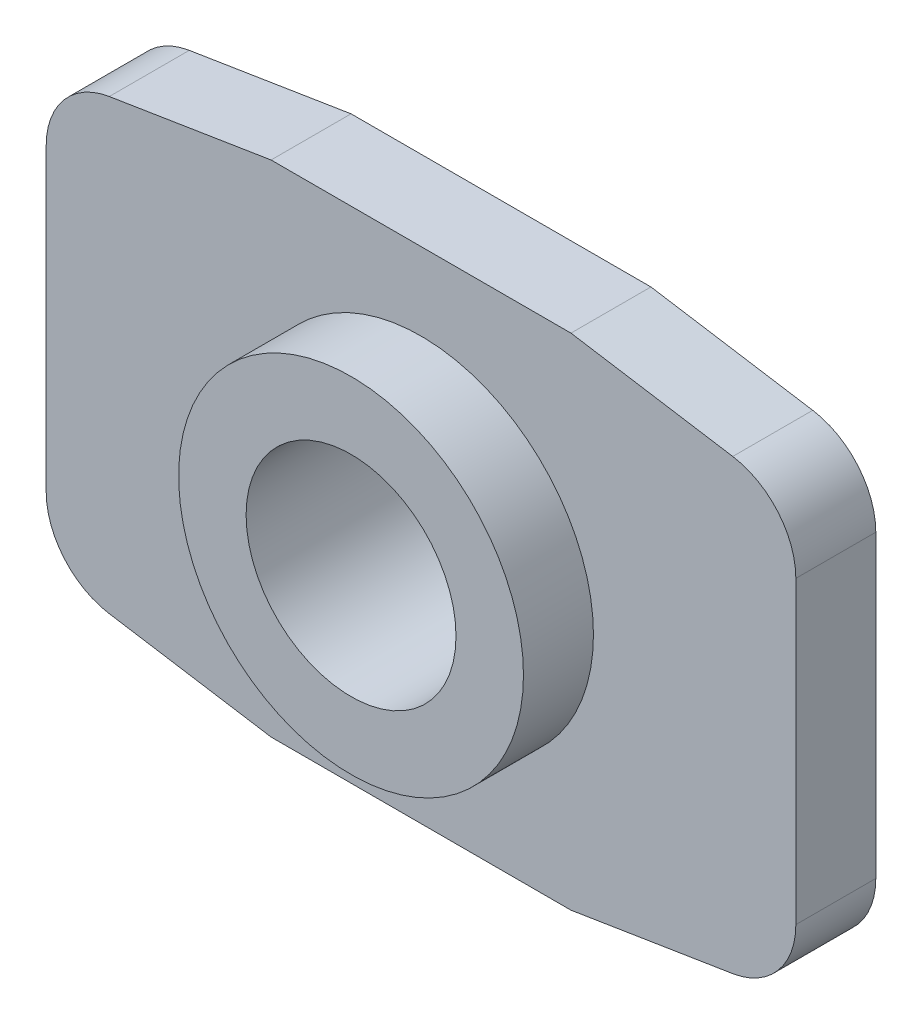
ISO-10303-21;
HEADER;
FILE_DESCRIPTION(('STEP AP214'),'2;1');
FILE_NAME('part.step','',(''),(''),'','','');
FILE_SCHEMA(('AUTOMOTIVE_DESIGN { 1 0 10303 214 1 1 1 1 }'));
ENDSEC;
DATA;
#1=APPLICATION_CONTEXT('core data for automotive mechanical design processes');
#2=APPLICATION_PROTOCOL_DEFINITION('international standard','automotive_design',2000,#1);
#3=PRODUCT_CONTEXT('',#1,'mechanical');
#4=PRODUCT('Part','Part','',(#3));
#5=PRODUCT_RELATED_PRODUCT_CATEGORY('part','',(#4));
#6=PRODUCT_DEFINITION_FORMATION('','',#4);
#7=PRODUCT_DEFINITION_CONTEXT('part definition',#1,'design');
#8=PRODUCT_DEFINITION('design','',#6,#7);
#9=PRODUCT_DEFINITION_SHAPE('','',#8);
#10=(LENGTH_UNIT() NAMED_UNIT(*) SI_UNIT(.MILLI.,.METRE.));
#11=(NAMED_UNIT(*) PLANE_ANGLE_UNIT() SI_UNIT($,.RADIAN.));
#12=(NAMED_UNIT(*) SI_UNIT($,.STERADIAN.) SOLID_ANGLE_UNIT());
#13=UNCERTAINTY_MEASURE_WITH_UNIT(LENGTH_MEASURE(1.E-05),#10,'distance_accuracy_value','');
#14=(GEOMETRIC_REPRESENTATION_CONTEXT(3) GLOBAL_UNCERTAINTY_ASSIGNED_CONTEXT((#13)) GLOBAL_UNIT_ASSIGNED_CONTEXT((#10,
#11,#12)) REPRESENTATION_CONTEXT('',''));
#15=CARTESIAN_POINT('',(0.,0.,0.));
#16=DIRECTION('',(0.,0.,1.));
#17=DIRECTION('',(1.,0.,0.));
#18=AXIS2_PLACEMENT_3D('',#15,#16,#17);
#19=CARTESIAN_POINT('',(6.00000000000023,3.00000000000333,1.59999999986882));
#20=DIRECTION('',(0.,0.,1.00000000000001));
#21=DIRECTION('',(1.00000000000001,0.,0.));
#22=AXIS2_PLACEMENT_3D('',#19,#20,#21);
#23=PLANE('',#22);
#24=CARTESIAN_POINT('',(6.00000000000023,3.00000000000333,1.59999999986882));
#25=DIRECTION('',(0.,0.,1.00000000000001));
#26=DIRECTION('',(1.00000000000001,0.,0.));
#27=AXIS2_PLACEMENT_3D('',#24,#25,#26);
#28=CIRCLE('',#27,1.5);
#29=CARTESIAN_POINT('',(7.50000000000028,3.00000000000393,1.59999999986926));
#30=VERTEX_POINT('',#29);
#31=CARTESIAN_POINT('',(6.23739675280444,4.48109512921095,1.59999999982974));
#32=VERTEX_POINT('',#31);
#33=EDGE_CURVE('E180',#30,#32,#28,.T.);
#34=ORIENTED_EDGE('',*,*,#33,.T.);
#35=DIRECTION('',(-0.98739675280409,0.158264501869375,0.));
#36=VECTOR('',#35,1.);
#37=CARTESIAN_POINT('',(6.23739675280444,4.48109512921095,1.59999999982974));
#38=LINE('',#37,#36);
#39=CARTESIAN_POINT('',(3.00000000000011,5.00000000000553,1.59999999982974));
#40=VERTEX_POINT('',#39);
#41=EDGE_CURVE('E108',#32,#40,#38,.T.);
#42=ORIENTED_EDGE('',*,*,#41,.T.);
#43=DIRECTION('',(-1.00000000000001,0.,0.));
#44=VECTOR('',#43,1.);
#45=CARTESIAN_POINT('',(-3.00000000000011,5.00000000000481,1.59999999983018));
#46=LINE('',#45,#44);
#47=CARTESIAN_POINT('',(-3.00000000000011,5.00000000000481,1.59999999983018));
#48=VERTEX_POINT('',#47);
#49=EDGE_CURVE('E207',#40,#48,#46,.T.);
#50=ORIENTED_EDGE('',*,*,#49,.T.);
#51=DIRECTION('',(-0.987396752804088,-0.158264501869399,0.));
#52=VECTOR('',#51,1.);
#53=CARTESIAN_POINT('',(-6.23739675280444,4.48109512921006,1.59999999982974));
#54=LINE('',#53,#52);
#55=CARTESIAN_POINT('',(-6.23739675280444,4.48109512921006,1.59999999982974));
#56=VERTEX_POINT('',#55);
#57=EDGE_CURVE('E225',#48,#56,#54,.T.);
#58=ORIENTED_EDGE('',*,*,#57,.T.);
#59=CARTESIAN_POINT('',(-6.00000000000023,3.00000000000249,1.59999999986882));
#60=DIRECTION('',(0.,0.,1.00000000000001));
#61=DIRECTION('',(-1.00000000000001,0.,0.));
#62=AXIS2_PLACEMENT_3D('',#59,#60,#61);
#63=CIRCLE('',#62,1.5);
#64=CARTESIAN_POINT('',(-7.50000000000028,3.00000000000378,1.59999999986882));
#65=VERTEX_POINT('',#64);
#66=EDGE_CURVE('E222',#56,#65,#63,.T.);
#67=ORIENTED_EDGE('',*,*,#66,.T.);
#68=DIRECTION('',(0.,-1.00000000000001,0.));
#69=VECTOR('',#68,1.);
#70=CARTESIAN_POINT('',(-7.50000000000028,-2.99999999999603,1.59999999999982));
#71=LINE('',#70,#69);
#72=CARTESIAN_POINT('',(-7.50000000000028,-2.99999999999603,1.59999999999982));
#73=VERTEX_POINT('',#72);
#74=EDGE_CURVE('E224',#65,#73,#71,.T.);
#75=ORIENTED_EDGE('',*,*,#74,.T.);
#76=CARTESIAN_POINT('',(-6.00000000000023,-2.99999999999774,1.59999999999982));
#77=DIRECTION('',(0.,0.,1.00000000000001));
#78=DIRECTION('',(1.00000000000001,0.,0.));
#79=AXIS2_PLACEMENT_3D('',#76,#77,#78);
#80=CIRCLE('',#79,1.5);
#81=CARTESIAN_POINT('',(-6.23739675280444,-4.48109512920229,1.59999999999982));
#82=VERTEX_POINT('',#81);
#83=EDGE_CURVE('E227',#73,#82,#80,.T.);
#84=ORIENTED_EDGE('',*,*,#83,.T.);
#85=DIRECTION('',(0.987396752804089,-0.158264501869373,0.));
#86=VECTOR('',#85,1.);
#87=CARTESIAN_POINT('',(-6.23739675280444,-4.48109512920229,1.59999999999982));
#88=LINE('',#87,#86);
#89=CARTESIAN_POINT('',(-3.00000000000011,-4.99999999999519,1.59999999999982));
#90=VERTEX_POINT('',#89);
#91=EDGE_CURVE('E233',#82,#90,#88,.T.);
#92=ORIENTED_EDGE('',*,*,#91,.T.);
#93=DIRECTION('',(1.00000000000001,0.,0.));
#94=VECTOR('',#93,1.);
#95=CARTESIAN_POINT('',(-3.00000000000011,-4.99999999999519,1.59999999999982));
#96=LINE('',#95,#94);
#97=CARTESIAN_POINT('',(3.00000000000011,-4.9999999999947,1.59999999999982));
#98=VERTEX_POINT('',#97);
#99=EDGE_CURVE('E139',#90,#98,#96,.T.);
#100=ORIENTED_EDGE('',*,*,#99,.T.);
#101=DIRECTION('',(0.987396752804086,0.158264501869398,0.));
#102=VECTOR('',#101,1.);
#103=CARTESIAN_POINT('',(6.23739675280444,-4.48109512920146,1.59999999999982));
#104=LINE('',#103,#102);
#105=CARTESIAN_POINT('',(6.23739675280444,-4.48109512920146,1.59999999999982));
#106=VERTEX_POINT('',#105);
#107=EDGE_CURVE('E133',#98,#106,#104,.T.);
#108=ORIENTED_EDGE('',*,*,#107,.T.);
#109=CARTESIAN_POINT('',(6.00000000000023,-2.99999999999648,1.59999999999982));
#110=DIRECTION('',(0.,0.,1.00000000000001));
#111=DIRECTION('',(-1.00000000000001,0.,0.));
#112=AXIS2_PLACEMENT_3D('',#109,#110,#111);
#113=CIRCLE('',#112,1.5);
#114=CARTESIAN_POINT('',(7.50000000000028,-2.99999999999634,1.59999999999982));
#115=VERTEX_POINT('',#114);
#116=EDGE_CURVE('E137',#106,#115,#113,.T.);
#117=ORIENTED_EDGE('',*,*,#116,.T.);
#118=DIRECTION('',(0.,1.,0.));
#119=VECTOR('',#118,1.);
#120=CARTESIAN_POINT('',(7.50000000000028,-2.99999999999634,1.59999999999982));
#121=LINE('',#120,#119);
#122=EDGE_CURVE('E53',#115,#30,#121,.T.);
#123=ORIENTED_EDGE('',*,*,#122,.T.);
#124=EDGE_LOOP('',(#34,#42,#50,#58,#67,#75,#84,#92,#100,#108,#117,#123));
#125=FACE_BOUND('',#124,.T.);
#126=CARTESIAN_POINT('',(0.,2.24820162486594E-12,1.59999999999982));
#127=DIRECTION('',(0.,0.,1.00000000000001));
#128=DIRECTION('',(1.00000000000001,0.,0.));
#129=AXIS2_PLACEMENT_3D('',#126,#127,#128);
#130=CIRCLE('',#129,3.45);
#131=CARTESIAN_POINT('',(3.45000000000004,2.29186669642445E-12,1.59999999999982));
#132=VERTEX_POINT('',#131);
#133=EDGE_CURVE('E285',#132,#132,#130,.T.);
#134=ORIENTED_EDGE('',*,*,#133,.F.);
#135=EDGE_LOOP('',(#134));
#136=FACE_BOUND('',#135,.T.);
#137=ADVANCED_FACE('F36',(#125,#136),#23,.T.);
#138=CARTESIAN_POINT('',(6.00000000000023,3.00000000000333,1.59999999986882));
#139=DIRECTION('',(0.,0.,-1.00000000000001));
#140=DIRECTION('',(-1.00000000000001,0.,0.));
#141=AXIS2_PLACEMENT_3D('',#138,#139,#140);
#142=CYLINDRICAL_SURFACE('',#141,1.5);
#143=CARTESIAN_POINT('',(6.00000000000023,3.00000000000168,-1.31006316905768E-10));
#144=DIRECTION('',(0.,0.,1.00000000000001));
#145=DIRECTION('',(1.00000000000001,0.,0.));
#146=AXIS2_PLACEMENT_3D('',#143,#144,#145);
#147=CIRCLE('',#146,1.5);
#148=CARTESIAN_POINT('',(7.50000000000028,3.00000000000167,-1.31006316905768E-10));
#149=VERTEX_POINT('',#148);
#150=CARTESIAN_POINT('',(6.23739675280444,4.48109512920856,-1.70086167372574E-10));
#151=VERTEX_POINT('',#150);
#152=EDGE_CURVE('E157',#149,#151,#147,.T.);
#153=ORIENTED_EDGE('',*,*,#152,.T.);
#154=DIRECTION('',(0.,0.,-1.00000000000001));
#155=VECTOR('',#154,1.);
#156=CARTESIAN_POINT('',(6.23739675280444,4.48109512921095,1.59999999982974));
#157=LINE('',#156,#155);
#158=EDGE_CURVE('E11',#32,#151,#157,.T.);
#159=ORIENTED_EDGE('',*,*,#158,.F.);
#160=ORIENTED_EDGE('',*,*,#33,.F.);
#161=DIRECTION('',(0.,0.,-1.00000000000001));
#162=VECTOR('',#161,1.);
#163=CARTESIAN_POINT('',(7.50000000000028,3.00000000000393,1.59999999986926));
#164=LINE('',#163,#162);
#165=EDGE_CURVE('E153',#30,#149,#164,.T.);
#166=ORIENTED_EDGE('',*,*,#165,.T.);
#167=EDGE_LOOP('',(#153,#159,#160,#166));
#168=FACE_BOUND('',#167,.T.);
#169=ADVANCED_FACE('F38',(#168),#142,.T.);
#170=CARTESIAN_POINT('',(6.23739675280444,4.48109512921095,1.59999999982974));
#171=DIRECTION('',(-0.158264501869399,-0.987396752804084,0.));
#172=DIRECTION('',(0.98739675280409,-0.158264501869375,0.));
#173=AXIS2_PLACEMENT_3D('',#170,#171,#172);
#174=PLANE('',#173);
#175=DIRECTION('',(-0.98739675280409,0.158264501869375,0.));
#176=VECTOR('',#175,1.);
#177=CARTESIAN_POINT('',(6.23739675280444,4.48109512920856,-1.70086167372574E-10));
#178=LINE('',#177,#176);
#179=CARTESIAN_POINT('',(3.00000000000011,5.00000000000309,-1.70086167372574E-10));
#180=VERTEX_POINT('',#179);
#181=EDGE_CURVE('E160',#151,#180,#178,.T.);
#182=ORIENTED_EDGE('',*,*,#181,.T.);
#183=DIRECTION('',(0.,0.,-1.00000000000001));
#184=VECTOR('',#183,1.);
#185=CARTESIAN_POINT('',(3.00000000000011,5.00000000000553,1.59999999982974));
#186=LINE('',#185,#184);
#187=EDGE_CURVE('E45',#40,#180,#186,.T.);
#188=ORIENTED_EDGE('',*,*,#187,.F.);
#189=ORIENTED_EDGE('',*,*,#41,.F.);
#190=ORIENTED_EDGE('',*,*,#158,.T.);
#191=EDGE_LOOP('',(#182,#188,#189,#190));
#192=FACE_BOUND('',#191,.T.);
#193=ADVANCED_FACE('F263',(#192),#174,.F.);
#194=CARTESIAN_POINT('',(-3.00000000000011,5.00000000000481,1.59999999983018));
#195=DIRECTION('',(0.,-1.00000000000001,0.));
#196=DIRECTION('',(0.,0.,-1.00000000000001));
#197=AXIS2_PLACEMENT_3D('',#194,#195,#196);
#198=PLANE('',#197);
#199=DIRECTION('',(-1.00000000000001,0.,0.));
#200=VECTOR('',#199,1.);
#201=CARTESIAN_POINT('',(-3.00000000000011,5.00000000000245,-1.70086167372574E-10));
#202=LINE('',#201,#200);
#203=CARTESIAN_POINT('',(-3.00000000000011,5.00000000000245,-1.70086167372574E-10));
#204=VERTEX_POINT('',#203);
#205=EDGE_CURVE('E163',#180,#204,#202,.T.);
#206=ORIENTED_EDGE('',*,*,#205,.T.);
#207=DIRECTION('',(0.,0.,-1.00000000000001));
#208=VECTOR('',#207,1.);
#209=CARTESIAN_POINT('',(-3.00000000000011,5.00000000000481,1.59999999983018));
#210=LINE('',#209,#208);
#211=EDGE_CURVE('E199',#48,#204,#210,.T.);
#212=ORIENTED_EDGE('',*,*,#211,.F.);
#213=ORIENTED_EDGE('',*,*,#49,.F.);
#214=ORIENTED_EDGE('',*,*,#187,.T.);
#215=EDGE_LOOP('',(#206,#212,#213,#214));
#216=FACE_BOUND('',#215,.T.);
#217=ADVANCED_FACE('F205',(#216),#198,.F.);
#218=CARTESIAN_POINT('',(-6.23739675280444,4.48109512921006,1.59999999982974));
#219=DIRECTION('',(0.158264501869376,-0.987396752804085,0.));
#220=DIRECTION('',(0.987396752804088,0.158264501869399,0.));
#221=AXIS2_PLACEMENT_3D('',#218,#219,#220);
#222=PLANE('',#221);
#223=DIRECTION('',(-0.987396752804088,-0.158264501869399,0.));
#224=VECTOR('',#223,1.);
#225=CARTESIAN_POINT('',(-6.23739675280444,4.48109512920765,-1.70086167372574E-10));
#226=LINE('',#225,#224);
#227=CARTESIAN_POINT('',(-6.23739675280444,4.48109512920765,-1.70086167372574E-10));
#228=VERTEX_POINT('',#227);
#229=EDGE_CURVE('E165',#204,#228,#226,.T.);
#230=ORIENTED_EDGE('',*,*,#229,.T.);
#231=DIRECTION('',(0.,0.,-1.00000000000001));
#232=VECTOR('',#231,1.);
#233=CARTESIAN_POINT('',(-6.23739675280444,4.48109512921006,1.59999999982974));
#234=LINE('',#233,#232);
#235=EDGE_CURVE('E196',#56,#228,#234,.T.);
#236=ORIENTED_EDGE('',*,*,#235,.F.);
#237=ORIENTED_EDGE('',*,*,#57,.F.);
#238=ORIENTED_EDGE('',*,*,#211,.T.);
#239=EDGE_LOOP('',(#230,#236,#237,#238));
#240=FACE_BOUND('',#239,.T.);
#241=ADVANCED_FACE('F216',(#240),#222,.F.);
#242=CARTESIAN_POINT('',(-6.00000000000023,3.00000000000249,1.59999999986882));
#243=DIRECTION('',(0.,0.,-1.00000000000001));
#244=DIRECTION('',(-1.00000000000001,0.,0.));
#245=AXIS2_PLACEMENT_3D('',#242,#243,#244);
#246=CYLINDRICAL_SURFACE('',#245,1.5);
#247=CARTESIAN_POINT('',(-6.00000000000023,3.00000000000018,-1.31006316905768E-10));
#248=DIRECTION('',(0.,0.,1.00000000000001));
#249=DIRECTION('',(-1.00000000000001,0.,0.));
#250=AXIS2_PLACEMENT_3D('',#247,#248,#249);
#251=CIRCLE('',#250,1.5);
#252=CARTESIAN_POINT('',(-7.50000000000028,3.00000000000131,-1.31006316905768E-10));
#253=VERTEX_POINT('',#252);
#254=EDGE_CURVE('E167',#228,#253,#251,.T.);
#255=ORIENTED_EDGE('',*,*,#254,.T.);
#256=DIRECTION('',(0.,0.,-1.00000000000001));
#257=VECTOR('',#256,1.);
#258=CARTESIAN_POINT('',(-7.50000000000028,3.00000000000378,1.59999999986882));
#259=LINE('',#258,#257);
#260=EDGE_CURVE('E193',#65,#253,#259,.T.);
#261=ORIENTED_EDGE('',*,*,#260,.F.);
#262=ORIENTED_EDGE('',*,*,#66,.F.);
#263=ORIENTED_EDGE('',*,*,#235,.T.);
#264=EDGE_LOOP('',(#255,#261,#262,#263));
#265=FACE_BOUND('',#264,.T.);
#266=ADVANCED_FACE('F220',(#265),#246,.T.);
#267=CARTESIAN_POINT('',(-7.50000000000028,-2.99999999999603,1.59999999999982));
#268=DIRECTION('',(1.00000000000001,0.,0.));
#269=DIRECTION('',(0.,0.,-1.00000000000001));
#270=AXIS2_PLACEMENT_3D('',#267,#268,#269);
#271=PLANE('',#270);
#272=DIRECTION('',(0.,-1.00000000000001,0.));
#273=VECTOR('',#272,1.);
#274=CARTESIAN_POINT('',(-7.50000000000028,-2.99999999999875,0.));
#275=LINE('',#274,#273);
#276=CARTESIAN_POINT('',(-7.50000000000028,-2.99999999999875,0.));
#277=VERTEX_POINT('',#276);
#278=EDGE_CURVE('E169',#253,#277,#275,.T.);
#279=ORIENTED_EDGE('',*,*,#278,.T.);
#280=DIRECTION('',(0.,0.,-1.00000000000001));
#281=VECTOR('',#280,1.);
#282=CARTESIAN_POINT('',(-7.50000000000028,-2.99999999999603,1.59999999999982));
#283=LINE('',#282,#281);
#284=EDGE_CURVE('E190',#73,#277,#283,.T.);
#285=ORIENTED_EDGE('',*,*,#284,.F.);
#286=ORIENTED_EDGE('',*,*,#74,.F.);
#287=ORIENTED_EDGE('',*,*,#260,.T.);
#288=EDGE_LOOP('',(#279,#285,#286,#287));
#289=FACE_BOUND('',#288,.T.);
#290=ADVANCED_FACE('F354',(#289),#271,.F.);
#291=CARTESIAN_POINT('',(-6.00000000000023,-2.99999999999774,1.59999999999982));
#292=DIRECTION('',(0.,0.,-1.00000000000001));
#293=DIRECTION('',(-1.00000000000001,0.,0.));
#294=AXIS2_PLACEMENT_3D('',#291,#292,#293);
#295=CYLINDRICAL_SURFACE('',#294,1.5);
#296=CARTESIAN_POINT('',(-6.00000000000023,-2.99999999999961,0.));
#297=DIRECTION('',(0.,0.,1.00000000000001));
#298=DIRECTION('',(1.00000000000001,0.,0.));
#299=AXIS2_PLACEMENT_3D('',#296,#297,#298);
#300=CIRCLE('',#299,1.5);
#301=CARTESIAN_POINT('',(-6.23739675280444,-4.48109512920442,0.));
#302=VERTEX_POINT('',#301);
#303=EDGE_CURVE('E171',#277,#302,#300,.T.);
#304=ORIENTED_EDGE('',*,*,#303,.T.);
#305=DIRECTION('',(0.,0.,-1.00000000000001));
#306=VECTOR('',#305,1.);
#307=CARTESIAN_POINT('',(-6.23739675280444,-4.48109512920229,1.59999999999982));
#308=LINE('',#307,#306);
#309=EDGE_CURVE('E187',#82,#302,#308,.T.);
#310=ORIENTED_EDGE('',*,*,#309,.F.);
#311=ORIENTED_EDGE('',*,*,#83,.F.);
#312=ORIENTED_EDGE('',*,*,#284,.T.);
#313=EDGE_LOOP('',(#304,#310,#311,#312));
#314=FACE_BOUND('',#313,.T.);
#315=ADVANCED_FACE('F345',(#314),#295,.T.);
#316=CARTESIAN_POINT('',(-6.23739675280444,-4.48109512920229,1.59999999999982));
#317=DIRECTION('',(0.158264501869399,0.987396752804084,0.));
#318=DIRECTION('',(-0.987396752804089,0.158264501869374,0.));
#319=AXIS2_PLACEMENT_3D('',#316,#317,#318);
#320=PLANE('',#319);
#321=DIRECTION('',(0.987396752804089,-0.158264501869373,0.));
#322=VECTOR('',#321,1.);
#323=CARTESIAN_POINT('',(-6.23739675280444,-4.48109512920442,0.));
#324=LINE('',#323,#322);
#325=CARTESIAN_POINT('',(-3.00000000000011,-4.99999999999726,0.));
#326=VERTEX_POINT('',#325);
#327=EDGE_CURVE('E173',#302,#326,#324,.T.);
#328=ORIENTED_EDGE('',*,*,#327,.T.);
#329=DIRECTION('',(0.,0.,-1.00000000000001));
#330=VECTOR('',#329,1.);
#331=CARTESIAN_POINT('',(-3.00000000000011,-4.99999999999519,1.59999999999982));
#332=LINE('',#331,#330);
#333=EDGE_CURVE('E184',#90,#326,#332,.T.);
#334=ORIENTED_EDGE('',*,*,#333,.F.);
#335=ORIENTED_EDGE('',*,*,#91,.F.);
#336=ORIENTED_EDGE('',*,*,#309,.T.);
#337=EDGE_LOOP('',(#328,#334,#335,#336));
#338=FACE_BOUND('',#337,.T.);
#339=ADVANCED_FACE('F239',(#338),#320,.F.);
#340=CARTESIAN_POINT('',(-3.00000000000011,-4.99999999999519,1.59999999999982));
#341=DIRECTION('',(0.,1.00000000000001,0.));
#342=DIRECTION('',(0.,0.,1.00000000000001));
#343=AXIS2_PLACEMENT_3D('',#340,#341,#342);
#344=PLANE('',#343);
#345=DIRECTION('',(1.00000000000001,0.,0.));
#346=VECTOR('',#345,1.);
#347=CARTESIAN_POINT('',(-3.00000000000011,-4.99999999999726,0.));
#348=LINE('',#347,#346);
#349=CARTESIAN_POINT('',(3.00000000000011,-4.99999999999716,0.));
#350=VERTEX_POINT('',#349);
#351=EDGE_CURVE('E175',#326,#350,#348,.T.);
#352=ORIENTED_EDGE('',*,*,#351,.T.);
#353=DIRECTION('',(0.,0.,-1.00000000000001));
#354=VECTOR('',#353,1.);
#355=CARTESIAN_POINT('',(3.00000000000011,-4.9999999999947,1.59999999999982));
#356=LINE('',#355,#354);
#357=EDGE_CURVE('E148',#98,#350,#356,.T.);
#358=ORIENTED_EDGE('',*,*,#357,.F.);
#359=ORIENTED_EDGE('',*,*,#99,.F.);
#360=ORIENTED_EDGE('',*,*,#333,.T.);
#361=EDGE_LOOP('',(#352,#358,#359,#360));
#362=FACE_BOUND('',#361,.T.);
#363=ADVANCED_FACE('F243',(#362),#344,.F.);
#364=CARTESIAN_POINT('',(6.23739675280444,-4.48109512920146,1.59999999999982));
#365=DIRECTION('',(-0.158264501869375,0.987396752804085,0.));
#366=DIRECTION('',(-0.987396752804087,-0.158264501869399,0.));
#367=AXIS2_PLACEMENT_3D('',#364,#365,#366);
#368=PLANE('',#367);
#369=DIRECTION('',(0.987396752804086,0.158264501869398,0.));
#370=VECTOR('',#369,1.);
#371=CARTESIAN_POINT('',(6.23739675280444,-4.48109512920382,0.));
#372=LINE('',#371,#370);
#373=CARTESIAN_POINT('',(6.23739675280444,-4.48109512920382,0.));
#374=VERTEX_POINT('',#373);
#375=EDGE_CURVE('E147',#350,#374,#372,.T.);
#376=ORIENTED_EDGE('',*,*,#375,.T.);
#377=DIRECTION('',(0.,0.,-1.00000000000001));
#378=VECTOR('',#377,1.);
#379=CARTESIAN_POINT('',(6.23739675280444,-4.48109512920146,1.59999999999982));
#380=LINE('',#379,#378);
#381=EDGE_CURVE('E144',#106,#374,#380,.T.);
#382=ORIENTED_EDGE('',*,*,#381,.F.);
#383=ORIENTED_EDGE('',*,*,#107,.F.);
#384=ORIENTED_EDGE('',*,*,#357,.T.);
#385=EDGE_LOOP('',(#376,#382,#383,#384));
#386=FACE_BOUND('',#385,.T.);
#387=ADVANCED_FACE('F145',(#386),#368,.F.);
#388=CARTESIAN_POINT('',(6.00000000000023,-2.99999999999648,1.59999999999982));
#389=DIRECTION('',(0.,0.,-1.00000000000001));
#390=DIRECTION('',(-1.00000000000001,0.,0.));
#391=AXIS2_PLACEMENT_3D('',#388,#389,#390);
#392=CYLINDRICAL_SURFACE('',#391,1.5);
#393=CARTESIAN_POINT('',(6.00000000000023,-2.99999999999866,0.));
#394=DIRECTION('',(0.,0.,1.00000000000001));
#395=DIRECTION('',(-1.00000000000001,0.,0.));
#396=AXIS2_PLACEMENT_3D('',#393,#394,#395);
#397=CIRCLE('',#396,1.5);
#398=CARTESIAN_POINT('',(7.50000000000028,-2.99999999999873,0.));
#399=VERTEX_POINT('',#398);
#400=EDGE_CURVE('E94',#374,#399,#397,.T.);
#401=ORIENTED_EDGE('',*,*,#400,.T.);
#402=DIRECTION('',(0.,0.,-1.00000000000001));
#403=VECTOR('',#402,1.);
#404=CARTESIAN_POINT('',(7.50000000000028,-2.99999999999634,1.59999999999982));
#405=LINE('',#404,#403);
#406=EDGE_CURVE('E149',#115,#399,#405,.T.);
#407=ORIENTED_EDGE('',*,*,#406,.F.);
#408=ORIENTED_EDGE('',*,*,#116,.F.);
#409=ORIENTED_EDGE('',*,*,#381,.T.);
#410=EDGE_LOOP('',(#401,#407,#408,#409));
#411=FACE_BOUND('',#410,.T.);
#412=ADVANCED_FACE('F151',(#411),#392,.T.);
#413=CARTESIAN_POINT('',(7.50000000000028,-2.99999999999634,1.59999999999982));
#414=DIRECTION('',(-1.00000000000001,0.,0.));
#415=DIRECTION('',(0.,-1.,0.));
#416=AXIS2_PLACEMENT_3D('',#413,#414,#415);
#417=PLANE('',#416);
#418=DIRECTION('',(0.,1.,0.));
#419=VECTOR('',#418,1.);
#420=CARTESIAN_POINT('',(7.50000000000028,-2.99999999999873,0.));
#421=LINE('',#420,#419);
#422=EDGE_CURVE('E100',#399,#149,#421,.T.);
#423=ORIENTED_EDGE('',*,*,#422,.T.);
#424=ORIENTED_EDGE('',*,*,#165,.F.);
#425=ORIENTED_EDGE('',*,*,#122,.F.);
#426=ORIENTED_EDGE('',*,*,#406,.T.);
#427=EDGE_LOOP('',(#423,#424,#425,#426));
#428=FACE_BOUND('',#427,.T.);
#429=ADVANCED_FACE('F247',(#428),#417,.F.);
#430=CARTESIAN_POINT('',(6.00000000000023,3.00000000000168,-1.31006316905768E-10));
#431=DIRECTION('',(0.,0.,1.00000000000001));
#432=DIRECTION('',(1.00000000000001,0.,0.));
#433=AXIS2_PLACEMENT_3D('',#430,#431,#432);
#434=PLANE('',#433);
#435=CARTESIAN_POINT('',(0.,0.,0.));
#436=DIRECTION('',(0.,0.,1.00000000000001));
#437=DIRECTION('',(1.00000000000001,0.,0.));
#438=AXIS2_PLACEMENT_3D('',#435,#436,#437);
#439=CIRCLE('',#438,2.1);
#440=CARTESIAN_POINT('',(2.10000000000002,0.,0.));
#441=VERTEX_POINT('',#440);
#442=EDGE_CURVE('E280',#441,#441,#439,.T.);
#443=ORIENTED_EDGE('',*,*,#442,.T.);
#444=EDGE_LOOP('',(#443));
#445=FACE_BOUND('',#444,.T.);
#446=ORIENTED_EDGE('',*,*,#152,.F.);
#447=ORIENTED_EDGE('',*,*,#422,.F.);
#448=ORIENTED_EDGE('',*,*,#400,.F.);
#449=ORIENTED_EDGE('',*,*,#375,.F.);
#450=ORIENTED_EDGE('',*,*,#351,.F.);
#451=ORIENTED_EDGE('',*,*,#327,.F.);
#452=ORIENTED_EDGE('',*,*,#303,.F.);
#453=ORIENTED_EDGE('',*,*,#278,.F.);
#454=ORIENTED_EDGE('',*,*,#254,.F.);
#455=ORIENTED_EDGE('',*,*,#229,.F.);
#456=ORIENTED_EDGE('',*,*,#205,.F.);
#457=ORIENTED_EDGE('',*,*,#181,.F.);
#458=EDGE_LOOP('',(#446,#447,#448,#449,#450,#451,#452,#453,#454,#455,#456,#457));
#459=FACE_BOUND('',#458,.T.);
#460=ADVANCED_FACE('F211',(#445,#459),#434,.F.);
#461=CARTESIAN_POINT('',(0.,-2.4980018054066E-13,3.00000000000011));
#462=DIRECTION('',(0.,0.,-1.00000000000001));
#463=DIRECTION('',(-1.00000000000001,0.,0.));
#464=AXIS2_PLACEMENT_3D('',#461,#462,#463);
#465=CYLINDRICAL_SURFACE('',#464,3.45);
#466=CARTESIAN_POINT('',(0.,-2.4980018054066E-13,3.00000000000011));
#467=DIRECTION('',(0.,0.,1.00000000000001));
#468=DIRECTION('',(1.00000000000001,0.,0.));
#469=AXIS2_PLACEMENT_3D('',#466,#467,#468);
#470=CIRCLE('',#469,3.45);
#471=CARTESIAN_POINT('',(3.45000000000004,-2.06135108982153E-13,3.00000000000011));
#472=VERTEX_POINT('',#471);
#473=EDGE_CURVE('E161',#472,#472,#470,.T.);
#474=ORIENTED_EDGE('',*,*,#473,.F.);
#475=EDGE_LOOP('',(#474));
#476=FACE_BOUND('',#475,.T.);
#477=ORIENTED_EDGE('',*,*,#133,.T.);
#478=EDGE_LOOP('',(#477));
#479=FACE_BOUND('',#478,.T.);
#480=ADVANCED_FACE('F254',(#476,#479),#465,.T.);
#481=CARTESIAN_POINT('',(0.,-2.4980018054066E-13,3.00000000000011));
#482=DIRECTION('',(0.,0.,1.00000000000001));
#483=DIRECTION('',(1.00000000000001,0.,0.));
#484=AXIS2_PLACEMENT_3D('',#481,#482,#483);
#485=PLANE('',#484);
#486=CARTESIAN_POINT('',(0.,-2.4980018054066E-13,3.00000000000011));
#487=DIRECTION('',(0.,0.,1.00000000000001));
#488=DIRECTION('',(1.00000000000001,0.,0.));
#489=AXIS2_PLACEMENT_3D('',#486,#487,#488);
#490=CIRCLE('',#489,2.09999999999999);
#491=CARTESIAN_POINT('',(2.10000000000001,-2.23221441331134E-13,3.00000000000011));
#492=VERTEX_POINT('',#491);
#493=EDGE_CURVE('E283',#492,#492,#490,.T.);
#494=ORIENTED_EDGE('',*,*,#493,.F.);
#495=EDGE_LOOP('',(#494));
#496=FACE_BOUND('',#495,.T.);
#497=ORIENTED_EDGE('',*,*,#473,.T.);
#498=EDGE_LOOP('',(#497));
#499=FACE_BOUND('',#498,.T.);
#500=ADVANCED_FACE('F267',(#496,#499),#485,.T.);
#501=CARTESIAN_POINT('',(0.,-2.4980018054066E-13,3.00000000000011));
#502=DIRECTION('',(0.,0.,1.00000000000001));
#503=DIRECTION('',(1.00000000000001,0.,0.));
#504=AXIS2_PLACEMENT_3D('',#501,#502,#503);
#505=CYLINDRICAL_SURFACE('',#504,2.09999999999999);
#506=ORIENTED_EDGE('',*,*,#442,.F.);
#507=EDGE_LOOP('',(#506));
#508=FACE_BOUND('',#507,.T.);
#509=ORIENTED_EDGE('',*,*,#493,.T.);
#510=EDGE_LOOP('',(#509));
#511=FACE_BOUND('',#510,.T.);
#512=ADVANCED_FACE('F271',(#508,#511),#505,.F.);
#513=CLOSED_SHELL('',(#137,#169,#193,#217,#241,#266,#290,#315,#339,#363,#387,#412,#429,#460,
#480,#500,#512));
#514=MANIFOLD_SOLID_BREP('B2',#513);
#515=ADVANCED_BREP_SHAPE_REPRESENTATION('',(#18,#514),#14);
#516=SHAPE_DEFINITION_REPRESENTATION(#9,#515);
ENDSEC;
END-ISO-10303-21;
